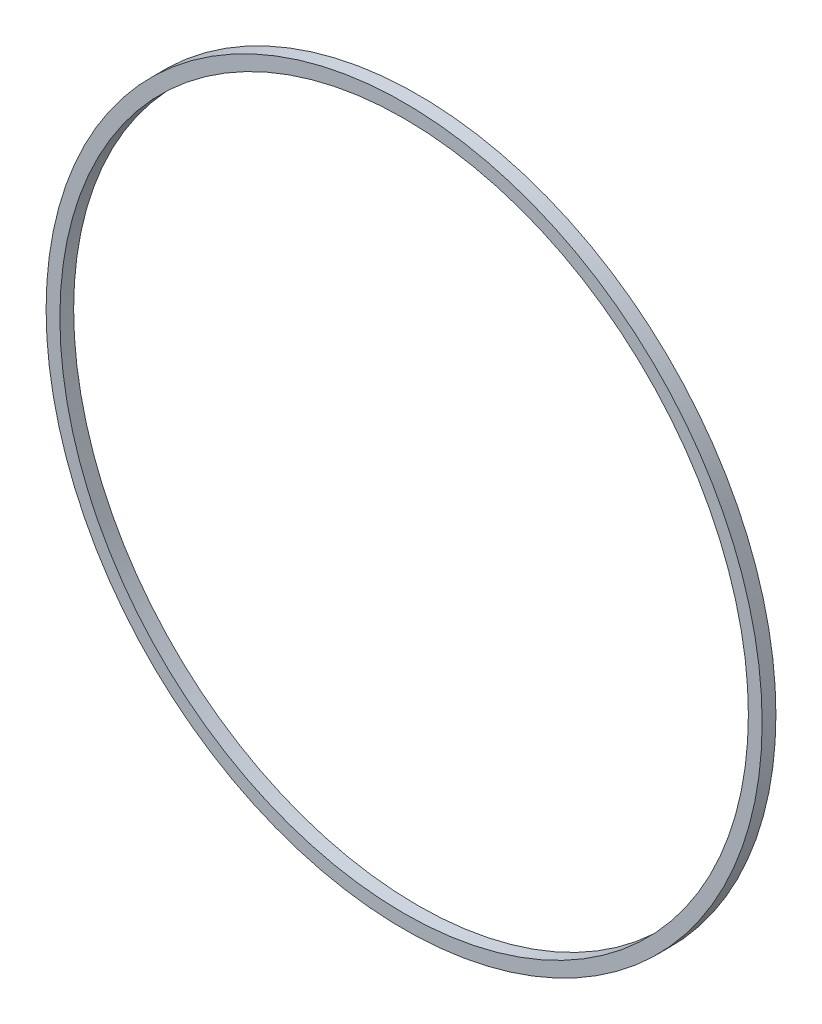
ISO-10303-21;
HEADER;
FILE_DESCRIPTION(('STEP AP214'),'2;1');
FILE_NAME('part.step','',(''),(''),'','','');
FILE_SCHEMA(('AUTOMOTIVE_DESIGN { 1 0 10303 214 1 1 1 1 }'));
ENDSEC;
DATA;
#1=APPLICATION_CONTEXT('core data for automotive mechanical design processes');
#2=APPLICATION_PROTOCOL_DEFINITION('international standard','automotive_design',2000,#1);
#3=PRODUCT_CONTEXT('',#1,'mechanical');
#4=PRODUCT('Part','Part','',(#3));
#5=PRODUCT_RELATED_PRODUCT_CATEGORY('part','',(#4));
#6=PRODUCT_DEFINITION_FORMATION('','',#4);
#7=PRODUCT_DEFINITION_CONTEXT('part definition',#1,'design');
#8=PRODUCT_DEFINITION('design','',#6,#7);
#9=PRODUCT_DEFINITION_SHAPE('','',#8);
#10=(LENGTH_UNIT() NAMED_UNIT(*) SI_UNIT(.MILLI.,.METRE.));
#11=(NAMED_UNIT(*) PLANE_ANGLE_UNIT() SI_UNIT($,.RADIAN.));
#12=(NAMED_UNIT(*) SI_UNIT($,.STERADIAN.) SOLID_ANGLE_UNIT());
#13=UNCERTAINTY_MEASURE_WITH_UNIT(LENGTH_MEASURE(1.E-05),#10,'distance_accuracy_value','');
#14=(GEOMETRIC_REPRESENTATION_CONTEXT(3) GLOBAL_UNCERTAINTY_ASSIGNED_CONTEXT((#13)) GLOBAL_UNIT_ASSIGNED_CONTEXT((#10,
#11,#12)) REPRESENTATION_CONTEXT('',''));
#15=CARTESIAN_POINT('',(0.,0.,0.));
#16=DIRECTION('',(0.,0.,1.));
#17=DIRECTION('',(1.,0.,0.));
#18=AXIS2_PLACEMENT_3D('',#15,#16,#17);
#19=CARTESIAN_POINT('',(0.,0.,2.54));
#20=DIRECTION('',(0.,0.,1.));
#21=DIRECTION('',(1.,0.,0.));
#22=AXIS2_PLACEMENT_3D('',#19,#20,#21);
#23=PLANE('',#22);
#24=CARTESIAN_POINT('',(0.,0.,2.54));
#25=DIRECTION('',(0.,0.,1.));
#26=DIRECTION('',(1.,0.,0.));
#27=AXIS2_PLACEMENT_3D('',#24,#25,#26);
#28=CIRCLE('',#27,66.04);
#29=CARTESIAN_POINT('',(66.04,0.,2.54));
#30=VERTEX_POINT('',#29);
#31=EDGE_CURVE('E10',#30,#30,#28,.T.);
#32=ORIENTED_EDGE('',*,*,#31,.T.);
#33=EDGE_LOOP('',(#32));
#34=FACE_BOUND('',#33,.T.);
#35=CARTESIAN_POINT('',(0.,0.,2.54));
#36=DIRECTION('',(0.,0.,1.));
#37=DIRECTION('',(1.,0.,0.));
#38=AXIS2_PLACEMENT_3D('',#35,#36,#37);
#39=CIRCLE('',#38,63.4999999999999);
#40=CARTESIAN_POINT('',(63.4999999999999,0.,2.54));
#41=VERTEX_POINT('',#40);
#42=EDGE_CURVE('E46',#41,#41,#39,.T.);
#43=ORIENTED_EDGE('',*,*,#42,.F.);
#44=EDGE_LOOP('',(#43));
#45=FACE_BOUND('',#44,.T.);
#46=ADVANCED_FACE('F35',(#34,#45),#23,.T.);
#47=CARTESIAN_POINT('',(0.,0.,0.));
#48=DIRECTION('',(0.,0.,1.));
#49=DIRECTION('',(1.,0.,0.));
#50=AXIS2_PLACEMENT_3D('',#47,#48,#49);
#51=PLANE('',#50);
#52=CARTESIAN_POINT('',(0.,0.,0.));
#53=DIRECTION('',(0.,0.,1.));
#54=DIRECTION('',(1.,0.,0.));
#55=AXIS2_PLACEMENT_3D('',#52,#53,#54);
#56=CIRCLE('',#55,66.04);
#57=CARTESIAN_POINT('',(66.04,0.,0.));
#58=VERTEX_POINT('',#57);
#59=EDGE_CURVE('E39',#58,#58,#56,.T.);
#60=ORIENTED_EDGE('',*,*,#59,.F.);
#61=EDGE_LOOP('',(#60));
#62=FACE_BOUND('',#61,.T.);
#63=CARTESIAN_POINT('',(0.,0.,0.));
#64=DIRECTION('',(0.,0.,1.));
#65=DIRECTION('',(1.,0.,0.));
#66=AXIS2_PLACEMENT_3D('',#63,#64,#65);
#67=CIRCLE('',#66,63.4999999999999);
#68=CARTESIAN_POINT('',(63.4999999999999,0.,0.));
#69=VERTEX_POINT('',#68);
#70=EDGE_CURVE('E48',#69,#69,#67,.T.);
#71=ORIENTED_EDGE('',*,*,#70,.T.);
#72=EDGE_LOOP('',(#71));
#73=FACE_BOUND('',#72,.T.);
#74=ADVANCED_FACE('F58',(#62,#73),#51,.F.);
#75=CARTESIAN_POINT('',(0.,0.,2.54));
#76=DIRECTION('',(0.,0.,-1.));
#77=DIRECTION('',(-1.,0.,0.));
#78=AXIS2_PLACEMENT_3D('',#75,#76,#77);
#79=CYLINDRICAL_SURFACE('',#78,66.04);
#80=ORIENTED_EDGE('',*,*,#31,.F.);
#81=EDGE_LOOP('',(#80));
#82=FACE_BOUND('',#81,.T.);
#83=ORIENTED_EDGE('',*,*,#59,.T.);
#84=EDGE_LOOP('',(#83));
#85=FACE_BOUND('',#84,.T.);
#86=ADVANCED_FACE('F37',(#82,#85),#79,.T.);
#87=CARTESIAN_POINT('',(0.,0.,2.54));
#88=DIRECTION('',(0.,0.,-1.));
#89=DIRECTION('',(-1.,0.,0.));
#90=AXIS2_PLACEMENT_3D('',#87,#88,#89);
#91=CYLINDRICAL_SURFACE('',#90,63.4999999999999);
#92=ORIENTED_EDGE('',*,*,#42,.T.);
#93=EDGE_LOOP('',(#92));
#94=FACE_BOUND('',#93,.T.);
#95=ORIENTED_EDGE('',*,*,#70,.F.);
#96=EDGE_LOOP('',(#95));
#97=FACE_BOUND('',#96,.T.);
#98=ADVANCED_FACE('F54',(#94,#97),#91,.F.);
#99=CLOSED_SHELL('',(#46,#74,#86,#98));
#100=MANIFOLD_SOLID_BREP('B2',#99);
#101=ADVANCED_BREP_SHAPE_REPRESENTATION('',(#18,#100),#14);
#102=SHAPE_DEFINITION_REPRESENTATION(#9,#101);
ENDSEC;
END-ISO-10303-21;
